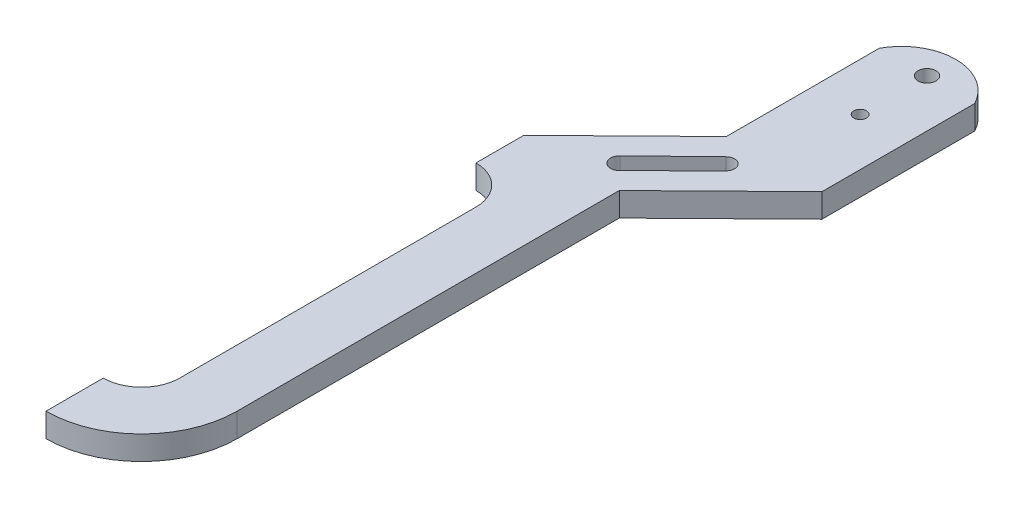
ISO-10303-21;
HEADER;
FILE_DESCRIPTION(('STEP AP214'),'2;1');
FILE_NAME('part.step','',(''),(''),'','','');
FILE_SCHEMA(('AUTOMOTIVE_DESIGN { 1 0 10303 214 1 1 1 1 }'));
ENDSEC;
DATA;
#1=APPLICATION_CONTEXT('core data for automotive mechanical design processes');
#2=APPLICATION_PROTOCOL_DEFINITION('international standard','automotive_design',2000,#1);
#3=PRODUCT_CONTEXT('',#1,'mechanical');
#4=PRODUCT('Part','Part','',(#3));
#5=PRODUCT_RELATED_PRODUCT_CATEGORY('part','',(#4));
#6=PRODUCT_DEFINITION_FORMATION('','',#4);
#7=PRODUCT_DEFINITION_CONTEXT('part definition',#1,'design');
#8=PRODUCT_DEFINITION('design','',#6,#7);
#9=PRODUCT_DEFINITION_SHAPE('','',#8);
#10=(LENGTH_UNIT() NAMED_UNIT(*) SI_UNIT(.MILLI.,.METRE.));
#11=(NAMED_UNIT(*) PLANE_ANGLE_UNIT() SI_UNIT($,.RADIAN.));
#12=(NAMED_UNIT(*) SI_UNIT($,.STERADIAN.) SOLID_ANGLE_UNIT());
#13=UNCERTAINTY_MEASURE_WITH_UNIT(LENGTH_MEASURE(1.E-05),#10,'distance_accuracy_value','');
#14=(GEOMETRIC_REPRESENTATION_CONTEXT(3) GLOBAL_UNCERTAINTY_ASSIGNED_CONTEXT((#13)) GLOBAL_UNIT_ASSIGNED_CONTEXT((#10,
#11,#12)) REPRESENTATION_CONTEXT('',''));
#15=CARTESIAN_POINT('',(0.,0.,0.));
#16=DIRECTION('',(0.,0.,1.));
#17=DIRECTION('',(1.,0.,0.));
#18=AXIS2_PLACEMENT_3D('',#15,#16,#17);
#19=CARTESIAN_POINT('',(-13.6044211563741,3.175,89.535));
#20=DIRECTION('',(0.,-1.,0.));
#21=DIRECTION('',(0.,0.,-1.));
#22=AXIS2_PLACEMENT_3D('',#19,#20,#21);
#23=PLANE('',#22);
#24=CARTESIAN_POINT('',(6.35,3.175,13.97));
#25=DIRECTION('',(0.,1.,0.));
#26=DIRECTION('',(0.,0.,1.));
#27=AXIS2_PLACEMENT_3D('',#24,#25,#26);
#28=CIRCLE('',#27,0.840105);
#29=CARTESIAN_POINT('',(6.35,3.175,14.810105));
#30=VERTEX_POINT('',#29);
#31=EDGE_CURVE('E182',#30,#30,#28,.T.);
#32=ORIENTED_EDGE('',*,*,#31,.F.);
#33=EDGE_LOOP('',(#32));
#34=FACE_BOUND('',#33,.T.);
#35=CARTESIAN_POINT('',(6.35,3.175,5.08));
#36=DIRECTION('',(0.,1.,0.));
#37=DIRECTION('',(0.,0.,1.));
#38=AXIS2_PLACEMENT_3D('',#35,#36,#37);
#39=CIRCLE('',#38,1.190625);
#40=CARTESIAN_POINT('',(6.35,3.175,6.270625));
#41=VERTEX_POINT('',#40);
#42=EDGE_CURVE('E188',#41,#41,#39,.T.);
#43=ORIENTED_EDGE('',*,*,#42,.F.);
#44=EDGE_LOOP('',(#43));
#45=FACE_BOUND('',#44,.T.);
#46=CARTESIAN_POINT('',(-13.6044211563741,3.175,89.535));
#47=DIRECTION('',(0.,1.,0.));
#48=DIRECTION('',(0.,0.,-1.));
#49=AXIS2_PLACEMENT_3D('',#46,#47,#48);
#50=CIRCLE('',#49,12.7);
#51=CARTESIAN_POINT('',(-13.6044211563741,3.175,102.235));
#52=VERTEX_POINT('',#51);
#53=CARTESIAN_POINT('',(-0.90442115637412,3.175,89.535));
#54=VERTEX_POINT('',#53);
#55=EDGE_CURVE('E194',#52,#54,#50,.T.);
#56=ORIENTED_EDGE('',*,*,#55,.T.);
#57=DIRECTION('',(0.,0.,-1.));
#58=VECTOR('',#57,1.);
#59=CARTESIAN_POINT('',(-0.904421156374132,3.175,38.735));
#60=LINE('',#59,#58);
#61=CARTESIAN_POINT('',(-0.904421156374132,3.175,38.735));
#62=VERTEX_POINT('',#61);
#63=EDGE_CURVE('E197',#54,#62,#60,.T.);
#64=ORIENTED_EDGE('',*,*,#63,.T.);
#65=DIRECTION('',(0.714142842854285,0.,-0.7));
#66=VECTOR('',#65,1.);
#67=CARTESIAN_POINT('',(12.7,3.175,25.4));
#68=LINE('',#67,#66);
#69=CARTESIAN_POINT('',(12.7,3.175,25.4));
#70=VERTEX_POINT('',#69);
#71=EDGE_CURVE('E200',#62,#70,#68,.T.);
#72=ORIENTED_EDGE('',*,*,#71,.T.);
#73=DIRECTION('',(0.,0.,-1.));
#74=VECTOR('',#73,1.);
#75=CARTESIAN_POINT('',(12.7,3.175,25.4));
#76=LINE('',#75,#74);
#77=CARTESIAN_POINT('',(12.7,3.175,5.08));
#78=VERTEX_POINT('',#77);
#79=EDGE_CURVE('E202',#70,#78,#76,.T.);
#80=ORIENTED_EDGE('',*,*,#79,.T.);
#81=CARTESIAN_POINT('',(6.35,3.175,8.46666666666668));
#82=DIRECTION('',(0.,1.,0.));
#83=DIRECTION('',(0.,0.,-1.));
#84=AXIS2_PLACEMENT_3D('',#81,#82,#83);
#85=CIRCLE('',#84,7.19666666666667);
#86=CARTESIAN_POINT('',(0.,3.175,5.08));
#87=VERTEX_POINT('',#86);
#88=EDGE_CURVE('E204',#78,#87,#85,.T.);
#89=ORIENTED_EDGE('',*,*,#88,.T.);
#90=DIRECTION('',(0.,0.,1.));
#91=VECTOR('',#90,1.);
#92=CARTESIAN_POINT('',(0.,3.175,5.08));
#93=LINE('',#92,#91);
#94=CARTESIAN_POINT('',(0.,3.175,25.4));
#95=VERTEX_POINT('',#94);
#96=EDGE_CURVE('E206',#87,#95,#93,.T.);
#97=ORIENTED_EDGE('',*,*,#96,.T.);
#98=DIRECTION('',(-0.714142842854285,0.,0.7));
#99=VECTOR('',#98,1.);
#100=CARTESIAN_POINT('',(0.,3.175,25.4));
#101=LINE('',#100,#99);
#102=CARTESIAN_POINT('',(-13.6044211563741,3.175,38.735));
#103=VERTEX_POINT('',#102);
#104=EDGE_CURVE('E208',#95,#103,#101,.T.);
#105=ORIENTED_EDGE('',*,*,#104,.T.);
#106=DIRECTION('',(0.,0.,1.));
#107=VECTOR('',#106,1.);
#108=CARTESIAN_POINT('',(-13.6044211563741,3.175,38.735));
#109=LINE('',#108,#107);
#110=CARTESIAN_POINT('',(-13.6044211563741,3.175,45.085));
#111=VERTEX_POINT('',#110);
#112=EDGE_CURVE('E210',#103,#111,#109,.T.);
#113=ORIENTED_EDGE('',*,*,#112,.T.);
#114=CARTESIAN_POINT('',(-13.6044211563741,3.175,50.165));
#115=DIRECTION('',(0.,-1.,0.));
#116=DIRECTION('',(0.,0.,-1.));
#117=AXIS2_PLACEMENT_3D('',#114,#115,#116);
#118=CIRCLE('',#117,5.08);
#119=CARTESIAN_POINT('',(-8.52442115637412,3.175,50.165));
#120=VERTEX_POINT('',#119);
#121=EDGE_CURVE('E212',#111,#120,#118,.T.);
#122=ORIENTED_EDGE('',*,*,#121,.T.);
#123=DIRECTION('',(0.,0.,1.));
#124=VECTOR('',#123,1.);
#125=CARTESIAN_POINT('',(-8.52442115637412,3.175,50.165));
#126=LINE('',#125,#124);
#127=CARTESIAN_POINT('',(-8.52442115637412,3.175,89.535));
#128=VERTEX_POINT('',#127);
#129=EDGE_CURVE('E214',#120,#128,#126,.T.);
#130=ORIENTED_EDGE('',*,*,#129,.T.);
#131=CARTESIAN_POINT('',(-13.6044211563741,3.175,89.535));
#132=DIRECTION('',(0.,-1.,0.));
#133=DIRECTION('',(0.,0.,-1.));
#134=AXIS2_PLACEMENT_3D('',#131,#132,#133);
#135=CIRCLE('',#134,5.08000000000001);
#136=CARTESIAN_POINT('',(-13.6044211563741,3.175,94.615));
#137=VERTEX_POINT('',#136);
#138=EDGE_CURVE('E216',#128,#137,#135,.T.);
#139=ORIENTED_EDGE('',*,*,#138,.T.);
#140=DIRECTION('',(0.,0.,1.));
#141=VECTOR('',#140,1.);
#142=CARTESIAN_POINT('',(-13.6044211563741,3.175,94.615));
#143=LINE('',#142,#141);
#144=EDGE_CURVE('E218',#137,#52,#143,.T.);
#145=ORIENTED_EDGE('',*,*,#144,.T.);
#146=EDGE_LOOP('',(#56,#64,#72,#80,#89,#97,#105,#113,#122,#130,#139,#145));
#147=FACE_BOUND('',#146,.T.);
#148=CARTESIAN_POINT('',(3.11149308184753,3.175,28.5743577970789));
#149=DIRECTION('',(0.,1.,0.));
#150=DIRECTION('',(0.,0.,1.));
#151=AXIS2_PLACEMENT_3D('',#148,#149,#150);
#152=CIRCLE('',#151,1.15081847955389);
#153=CARTESIAN_POINT('',(3.91706597680281,3.175,29.3962066176025));
#154=VERTEX_POINT('',#153);
#155=CARTESIAN_POINT('',(2.30592018689225,3.175,27.7525089765552));
#156=VERTEX_POINT('',#155);
#157=EDGE_CURVE('E146',#154,#156,#152,.T.);
#158=ORIENTED_EDGE('',*,*,#157,.F.);
#159=DIRECTION('',(0.710114988358506,0.,-0.704085721562793));
#160=VECTOR('',#159,1.);
#161=CARTESIAN_POINT('',(-3.17027228338043,3.175,36.4233694781073));
#162=LINE('',#161,#160);
#163=CARTESIAN_POINT('',(-3.17027228338043,3.175,36.4233694781073));
#164=VERTEX_POINT('',#163);
#165=EDGE_CURVE('E168',#164,#154,#162,.T.);
#166=ORIENTED_EDGE('',*,*,#165,.F.);
#167=CARTESIAN_POINT('',(-4.01592115637413,3.175,35.5606350635127));
#168=DIRECTION('',(0.,1.,0.));
#169=DIRECTION('',(0.,0.,-1.));
#170=AXIS2_PLACEMENT_3D('',#167,#168,#169);
#171=CIRCLE('',#170,1.20806981856242);
#172=CARTESIAN_POINT('',(-4.856606356463,3.175,34.6930631178661));
#173=VERTEX_POINT('',#172);
#174=EDGE_CURVE('E166',#173,#164,#171,.T.);
#175=ORIENTED_EDGE('',*,*,#174,.F.);
#176=DIRECTION('',(-0.718147190101119,0.,0.695891236724438));
#177=VECTOR('',#176,1.);
#178=CARTESIAN_POINT('',(2.30592018689225,3.175,27.7525089765552));
#179=LINE('',#178,#177);
#180=EDGE_CURVE('E154',#156,#173,#179,.T.);
#181=ORIENTED_EDGE('',*,*,#180,.F.);
#182=EDGE_LOOP('',(#158,#166,#175,#181));
#183=FACE_BOUND('',#182,.T.);
#184=ADVANCED_FACE('F33',(#34,#45,#147,#183),#23,.F.);
#185=CARTESIAN_POINT('',(-13.6044211563741,0.,89.535));
#186=DIRECTION('',(0.,-1.,0.));
#187=DIRECTION('',(0.,0.,-1.));
#188=AXIS2_PLACEMENT_3D('',#185,#186,#187);
#189=PLANE('',#188);
#190=CARTESIAN_POINT('',(6.35,0.,5.08));
#191=DIRECTION('',(0.,1.,0.));
#192=DIRECTION('',(0.,0.,1.));
#193=AXIS2_PLACEMENT_3D('',#190,#191,#192);
#194=CIRCLE('',#193,1.190625);
#195=CARTESIAN_POINT('',(6.35,0.,6.270625));
#196=VERTEX_POINT('',#195);
#197=EDGE_CURVE('E185',#196,#196,#194,.T.);
#198=ORIENTED_EDGE('',*,*,#197,.T.);
#199=EDGE_LOOP('',(#198));
#200=FACE_BOUND('',#199,.T.);
#201=CARTESIAN_POINT('',(-13.6044211563741,0.,89.535));
#202=DIRECTION('',(0.,1.,0.));
#203=DIRECTION('',(0.,0.,-1.));
#204=AXIS2_PLACEMENT_3D('',#201,#202,#203);
#205=CIRCLE('',#204,12.7);
#206=CARTESIAN_POINT('',(-13.6044211563741,0.,102.235));
#207=VERTEX_POINT('',#206);
#208=CARTESIAN_POINT('',(-0.90442115637412,0.,89.535));
#209=VERTEX_POINT('',#208);
#210=EDGE_CURVE('E191',#207,#209,#205,.T.);
#211=ORIENTED_EDGE('',*,*,#210,.F.);
#212=DIRECTION('',(0.,0.,1.));
#213=VECTOR('',#212,1.);
#214=CARTESIAN_POINT('',(-13.6044211563741,0.,94.615));
#215=LINE('',#214,#213);
#216=CARTESIAN_POINT('',(-13.6044211563741,0.,94.615));
#217=VERTEX_POINT('',#216);
#218=EDGE_CURVE('E198',#217,#207,#215,.T.);
#219=ORIENTED_EDGE('',*,*,#218,.F.);
#220=CARTESIAN_POINT('',(-13.6044211563741,0.,89.535));
#221=DIRECTION('',(0.,-1.,0.));
#222=DIRECTION('',(0.,0.,-1.));
#223=AXIS2_PLACEMENT_3D('',#220,#221,#222);
#224=CIRCLE('',#223,5.08000000000001);
#225=CARTESIAN_POINT('',(-8.52442115637412,0.,89.535));
#226=VERTEX_POINT('',#225);
#227=EDGE_CURVE('E242',#226,#217,#224,.T.);
#228=ORIENTED_EDGE('',*,*,#227,.F.);
#229=DIRECTION('',(0.,0.,1.));
#230=VECTOR('',#229,1.);
#231=CARTESIAN_POINT('',(-8.52442115637412,0.,50.165));
#232=LINE('',#231,#230);
#233=CARTESIAN_POINT('',(-8.52442115637412,0.,50.165));
#234=VERTEX_POINT('',#233);
#235=EDGE_CURVE('E240',#234,#226,#232,.T.);
#236=ORIENTED_EDGE('',*,*,#235,.F.);
#237=CARTESIAN_POINT('',(-13.6044211563741,0.,50.165));
#238=DIRECTION('',(0.,-1.,0.));
#239=DIRECTION('',(0.,0.,-1.));
#240=AXIS2_PLACEMENT_3D('',#237,#238,#239);
#241=CIRCLE('',#240,5.08);
#242=CARTESIAN_POINT('',(-13.6044211563741,0.,45.085));
#243=VERTEX_POINT('',#242);
#244=EDGE_CURVE('E238',#243,#234,#241,.T.);
#245=ORIENTED_EDGE('',*,*,#244,.F.);
#246=DIRECTION('',(0.,0.,1.));
#247=VECTOR('',#246,1.);
#248=CARTESIAN_POINT('',(-13.6044211563741,0.,38.735));
#249=LINE('',#248,#247);
#250=CARTESIAN_POINT('',(-13.6044211563741,0.,38.735));
#251=VERTEX_POINT('',#250);
#252=EDGE_CURVE('E236',#251,#243,#249,.T.);
#253=ORIENTED_EDGE('',*,*,#252,.F.);
#254=DIRECTION('',(-0.714142842854285,0.,0.7));
#255=VECTOR('',#254,1.);
#256=CARTESIAN_POINT('',(0.,0.,25.4));
#257=LINE('',#256,#255);
#258=CARTESIAN_POINT('',(0.,0.,25.4));
#259=VERTEX_POINT('',#258);
#260=EDGE_CURVE('E234',#259,#251,#257,.T.);
#261=ORIENTED_EDGE('',*,*,#260,.F.);
#262=DIRECTION('',(0.,0.,1.));
#263=VECTOR('',#262,1.);
#264=CARTESIAN_POINT('',(0.,0.,5.08));
#265=LINE('',#264,#263);
#266=CARTESIAN_POINT('',(0.,0.,5.08));
#267=VERTEX_POINT('',#266);
#268=EDGE_CURVE('E232',#267,#259,#265,.T.);
#269=ORIENTED_EDGE('',*,*,#268,.F.);
#270=CARTESIAN_POINT('',(6.35,0.,8.46666666666668));
#271=DIRECTION('',(0.,1.,0.));
#272=DIRECTION('',(0.,0.,1.));
#273=AXIS2_PLACEMENT_3D('',#270,#271,#272);
#274=CIRCLE('',#273,7.19666666666667);
#275=CARTESIAN_POINT('',(12.7,0.,5.08));
#276=VERTEX_POINT('',#275);
#277=EDGE_CURVE('E230',#276,#267,#274,.T.);
#278=ORIENTED_EDGE('',*,*,#277,.F.);
#279=DIRECTION('',(0.,0.,-1.));
#280=VECTOR('',#279,1.);
#281=CARTESIAN_POINT('',(12.7,0.,25.4));
#282=LINE('',#281,#280);
#283=CARTESIAN_POINT('',(12.7,0.,25.4));
#284=VERTEX_POINT('',#283);
#285=EDGE_CURVE('E227',#284,#276,#282,.T.);
#286=ORIENTED_EDGE('',*,*,#285,.F.);
#287=DIRECTION('',(0.714142842854285,0.,-0.7));
#288=VECTOR('',#287,1.);
#289=CARTESIAN_POINT('',(12.7,0.,25.4));
#290=LINE('',#289,#288);
#291=CARTESIAN_POINT('',(-0.904421156374132,0.,38.735));
#292=VERTEX_POINT('',#291);
#293=EDGE_CURVE('E225',#292,#284,#290,.T.);
#294=ORIENTED_EDGE('',*,*,#293,.F.);
#295=DIRECTION('',(0.,0.,-1.));
#296=VECTOR('',#295,1.);
#297=CARTESIAN_POINT('',(-0.904421156374132,0.,38.735));
#298=LINE('',#297,#296);
#299=EDGE_CURVE('E223',#209,#292,#298,.T.);
#300=ORIENTED_EDGE('',*,*,#299,.F.);
#301=EDGE_LOOP('',(#211,#219,#228,#236,#245,#253,#261,#269,#278,#286,#294,#300));
#302=FACE_BOUND('',#301,.T.);
#303=CARTESIAN_POINT('',(6.35,0.,13.97));
#304=DIRECTION('',(0.,1.,0.));
#305=DIRECTION('',(0.,0.,1.));
#306=AXIS2_PLACEMENT_3D('',#303,#304,#305);
#307=CIRCLE('',#306,0.840105);
#308=CARTESIAN_POINT('',(6.35,0.,14.810105));
#309=VERTEX_POINT('',#308);
#310=EDGE_CURVE('E162',#309,#309,#307,.T.);
#311=ORIENTED_EDGE('',*,*,#310,.T.);
#312=EDGE_LOOP('',(#311));
#313=FACE_BOUND('',#312,.T.);
#314=DIRECTION('',(0.710114988358506,0.,-0.704085721562793));
#315=VECTOR('',#314,1.);
#316=CARTESIAN_POINT('',(-3.17027228338043,0.,36.4233694781073));
#317=LINE('',#316,#315);
#318=CARTESIAN_POINT('',(-3.17027228338043,0.,36.4233694781073));
#319=VERTEX_POINT('',#318);
#320=CARTESIAN_POINT('',(3.91706597680282,0.,29.3962066176025));
#321=VERTEX_POINT('',#320);
#322=EDGE_CURVE('E155',#319,#321,#317,.T.);
#323=ORIENTED_EDGE('',*,*,#322,.T.);
#324=CARTESIAN_POINT('',(3.11149308184753,0.,28.5743577970789));
#325=DIRECTION('',(0.,1.,0.));
#326=DIRECTION('',(0.,0.,1.));
#327=AXIS2_PLACEMENT_3D('',#324,#325,#326);
#328=CIRCLE('',#327,1.15081847955389);
#329=CARTESIAN_POINT('',(2.30592018689225,0.,27.7525089765552));
#330=VERTEX_POINT('',#329);
#331=EDGE_CURVE('E56',#321,#330,#328,.T.);
#332=ORIENTED_EDGE('',*,*,#331,.T.);
#333=DIRECTION('',(-0.718147190101119,0.,0.695891236724438));
#334=VECTOR('',#333,1.);
#335=CARTESIAN_POINT('',(2.30592018689225,0.,27.7525089765552));
#336=LINE('',#335,#334);
#337=CARTESIAN_POINT('',(-4.856606356463,0.,34.6930631178661));
#338=VERTEX_POINT('',#337);
#339=EDGE_CURVE('E161',#330,#338,#336,.T.);
#340=ORIENTED_EDGE('',*,*,#339,.T.);
#341=CARTESIAN_POINT('',(-4.01592115637413,0.,35.5606350635127));
#342=DIRECTION('',(0.,1.,0.));
#343=DIRECTION('',(0.,0.,-1.));
#344=AXIS2_PLACEMENT_3D('',#341,#342,#343);
#345=CIRCLE('',#344,1.20806981856242);
#346=EDGE_CURVE('E174',#338,#319,#345,.T.);
#347=ORIENTED_EDGE('',*,*,#346,.T.);
#348=EDGE_LOOP('',(#323,#332,#340,#347));
#349=FACE_BOUND('',#348,.T.);
#350=ADVANCED_FACE('F284',(#200,#302,#313,#349),#189,.T.);
#351=CARTESIAN_POINT('',(-13.6044211563741,3.175,89.535));
#352=DIRECTION('',(0.,-1.,0.));
#353=DIRECTION('',(0.,0.,-1.));
#354=AXIS2_PLACEMENT_3D('',#351,#352,#353);
#355=CYLINDRICAL_SURFACE('',#354,12.7);
#356=ORIENTED_EDGE('',*,*,#210,.T.);
#357=DIRECTION('',(0.,-1.,0.));
#358=VECTOR('',#357,1.);
#359=CARTESIAN_POINT('',(-0.90442115637412,3.175,89.535));
#360=LINE('',#359,#358);
#361=EDGE_CURVE('E11',#54,#209,#360,.T.);
#362=ORIENTED_EDGE('',*,*,#361,.F.);
#363=ORIENTED_EDGE('',*,*,#55,.F.);
#364=DIRECTION('',(0.,-1.,0.));
#365=VECTOR('',#364,1.);
#366=CARTESIAN_POINT('',(-13.6044211563741,3.175,102.235));
#367=LINE('',#366,#365);
#368=EDGE_CURVE('E220',#52,#207,#367,.T.);
#369=ORIENTED_EDGE('',*,*,#368,.T.);
#370=EDGE_LOOP('',(#356,#362,#363,#369));
#371=FACE_BOUND('',#370,.T.);
#372=ADVANCED_FACE('F35',(#371),#355,.T.);
#373=CARTESIAN_POINT('',(-0.904421156374132,3.175,38.735));
#374=DIRECTION('',(-1.,0.,0.));
#375=DIRECTION('',(0.,0.,1.));
#376=AXIS2_PLACEMENT_3D('',#373,#374,#375);
#377=PLANE('',#376);
#378=ORIENTED_EDGE('',*,*,#299,.T.);
#379=DIRECTION('',(0.,-1.,0.));
#380=VECTOR('',#379,1.);
#381=CARTESIAN_POINT('',(-0.904421156374132,3.175,38.735));
#382=LINE('',#381,#380);
#383=EDGE_CURVE('E41',#62,#292,#382,.T.);
#384=ORIENTED_EDGE('',*,*,#383,.F.);
#385=ORIENTED_EDGE('',*,*,#63,.F.);
#386=ORIENTED_EDGE('',*,*,#361,.T.);
#387=EDGE_LOOP('',(#378,#384,#385,#386));
#388=FACE_BOUND('',#387,.T.);
#389=ADVANCED_FACE('F300',(#388),#377,.F.);
#390=CARTESIAN_POINT('',(12.7,3.175,25.4));
#391=DIRECTION('',(-0.7,0.,-0.714142842854285));
#392=DIRECTION('',(-0.714142842854285,0.,0.7));
#393=AXIS2_PLACEMENT_3D('',#390,#391,#392);
#394=PLANE('',#393);
#395=ORIENTED_EDGE('',*,*,#293,.T.);
#396=DIRECTION('',(0.,-1.,0.));
#397=VECTOR('',#396,1.);
#398=CARTESIAN_POINT('',(12.7,3.175,25.4));
#399=LINE('',#398,#397);
#400=EDGE_CURVE('E271',#70,#284,#399,.T.);
#401=ORIENTED_EDGE('',*,*,#400,.F.);
#402=ORIENTED_EDGE('',*,*,#71,.F.);
#403=ORIENTED_EDGE('',*,*,#383,.T.);
#404=EDGE_LOOP('',(#395,#401,#402,#403));
#405=FACE_BOUND('',#404,.T.);
#406=ADVANCED_FACE('F278',(#405),#394,.F.);
#407=CARTESIAN_POINT('',(12.7,3.175,25.4));
#408=DIRECTION('',(-1.,0.,0.));
#409=DIRECTION('',(0.,0.,1.));
#410=AXIS2_PLACEMENT_3D('',#407,#408,#409);
#411=PLANE('',#410);
#412=ORIENTED_EDGE('',*,*,#285,.T.);
#413=DIRECTION('',(0.,-1.,0.));
#414=VECTOR('',#413,1.);
#415=CARTESIAN_POINT('',(12.7,3.175,5.08));
#416=LINE('',#415,#414);
#417=EDGE_CURVE('E268',#78,#276,#416,.T.);
#418=ORIENTED_EDGE('',*,*,#417,.F.);
#419=ORIENTED_EDGE('',*,*,#79,.F.);
#420=ORIENTED_EDGE('',*,*,#400,.T.);
#421=EDGE_LOOP('',(#412,#418,#419,#420));
#422=FACE_BOUND('',#421,.T.);
#423=ADVANCED_FACE('F289',(#422),#411,.F.);
#424=CARTESIAN_POINT('',(6.35,3.175,8.46666666666668));
#425=DIRECTION('',(0.,-1.,0.));
#426=DIRECTION('',(0.,0.,-1.));
#427=AXIS2_PLACEMENT_3D('',#424,#425,#426);
#428=CYLINDRICAL_SURFACE('',#427,7.19666666666667);
#429=ORIENTED_EDGE('',*,*,#277,.T.);
#430=DIRECTION('',(0.,-1.,0.));
#431=VECTOR('',#430,1.);
#432=CARTESIAN_POINT('',(0.,3.175,5.08));
#433=LINE('',#432,#431);
#434=EDGE_CURVE('E265',#87,#267,#433,.T.);
#435=ORIENTED_EDGE('',*,*,#434,.F.);
#436=ORIENTED_EDGE('',*,*,#88,.F.);
#437=ORIENTED_EDGE('',*,*,#417,.T.);
#438=EDGE_LOOP('',(#429,#435,#436,#437));
#439=FACE_BOUND('',#438,.T.);
#440=ADVANCED_FACE('F293',(#439),#428,.T.);
#441=CARTESIAN_POINT('',(0.,3.175,5.08));
#442=DIRECTION('',(1.,0.,0.));
#443=DIRECTION('',(0.,0.,-1.));
#444=AXIS2_PLACEMENT_3D('',#441,#442,#443);
#445=PLANE('',#444);
#446=ORIENTED_EDGE('',*,*,#268,.T.);
#447=DIRECTION('',(0.,-1.,0.));
#448=VECTOR('',#447,1.);
#449=CARTESIAN_POINT('',(0.,3.175,25.4));
#450=LINE('',#449,#448);
#451=EDGE_CURVE('E262',#95,#259,#450,.T.);
#452=ORIENTED_EDGE('',*,*,#451,.F.);
#453=ORIENTED_EDGE('',*,*,#96,.F.);
#454=ORIENTED_EDGE('',*,*,#434,.T.);
#455=EDGE_LOOP('',(#446,#452,#453,#454));
#456=FACE_BOUND('',#455,.T.);
#457=ADVANCED_FACE('F333',(#456),#445,.F.);
#458=CARTESIAN_POINT('',(0.,3.175,25.4));
#459=DIRECTION('',(0.7,0.,0.714142842854285));
#460=DIRECTION('',(0.714142842854285,0.,-0.7));
#461=AXIS2_PLACEMENT_3D('',#458,#459,#460);
#462=PLANE('',#461);
#463=ORIENTED_EDGE('',*,*,#260,.T.);
#464=DIRECTION('',(0.,-1.,0.));
#465=VECTOR('',#464,1.);
#466=CARTESIAN_POINT('',(-13.6044211563741,3.175,38.735));
#467=LINE('',#466,#465);
#468=EDGE_CURVE('E259',#103,#251,#467,.T.);
#469=ORIENTED_EDGE('',*,*,#468,.F.);
#470=ORIENTED_EDGE('',*,*,#104,.F.);
#471=ORIENTED_EDGE('',*,*,#451,.T.);
#472=EDGE_LOOP('',(#463,#469,#470,#471));
#473=FACE_BOUND('',#472,.T.);
#474=ADVANCED_FACE('F331',(#473),#462,.F.);
#475=CARTESIAN_POINT('',(-13.6044211563741,3.175,38.735));
#476=DIRECTION('',(1.,0.,0.));
#477=DIRECTION('',(0.,0.,-1.));
#478=AXIS2_PLACEMENT_3D('',#475,#476,#477);
#479=PLANE('',#478);
#480=ORIENTED_EDGE('',*,*,#252,.T.);
#481=DIRECTION('',(0.,-1.,0.));
#482=VECTOR('',#481,1.);
#483=CARTESIAN_POINT('',(-13.6044211563741,3.175,45.085));
#484=LINE('',#483,#482);
#485=EDGE_CURVE('E256',#111,#243,#484,.T.);
#486=ORIENTED_EDGE('',*,*,#485,.F.);
#487=ORIENTED_EDGE('',*,*,#112,.F.);
#488=ORIENTED_EDGE('',*,*,#468,.T.);
#489=EDGE_LOOP('',(#480,#486,#487,#488));
#490=FACE_BOUND('',#489,.T.);
#491=ADVANCED_FACE('F327',(#490),#479,.F.);
#492=CARTESIAN_POINT('',(-13.6044211563741,3.175,50.165));
#493=DIRECTION('',(0.,-1.,0.));
#494=DIRECTION('',(0.,0.,-1.));
#495=AXIS2_PLACEMENT_3D('',#492,#493,#494);
#496=CYLINDRICAL_SURFACE('',#495,5.08);
#497=ORIENTED_EDGE('',*,*,#244,.T.);
#498=DIRECTION('',(0.,-1.,0.));
#499=VECTOR('',#498,1.);
#500=CARTESIAN_POINT('',(-8.52442115637412,3.175,50.165));
#501=LINE('',#500,#499);
#502=EDGE_CURVE('E253',#120,#234,#501,.T.);
#503=ORIENTED_EDGE('',*,*,#502,.F.);
#504=ORIENTED_EDGE('',*,*,#121,.F.);
#505=ORIENTED_EDGE('',*,*,#485,.T.);
#506=EDGE_LOOP('',(#497,#503,#504,#505));
#507=FACE_BOUND('',#506,.T.);
#508=ADVANCED_FACE('F322',(#507),#496,.F.);
#509=CARTESIAN_POINT('',(-8.52442115637412,3.175,50.165));
#510=DIRECTION('',(1.,0.,0.));
#511=DIRECTION('',(0.,0.,-1.));
#512=AXIS2_PLACEMENT_3D('',#509,#510,#511);
#513=PLANE('',#512);
#514=ORIENTED_EDGE('',*,*,#235,.T.);
#515=DIRECTION('',(0.,-1.,0.));
#516=VECTOR('',#515,1.);
#517=CARTESIAN_POINT('',(-8.52442115637412,3.175,89.535));
#518=LINE('',#517,#516);
#519=EDGE_CURVE('E250',#128,#226,#518,.T.);
#520=ORIENTED_EDGE('',*,*,#519,.F.);
#521=ORIENTED_EDGE('',*,*,#129,.F.);
#522=ORIENTED_EDGE('',*,*,#502,.T.);
#523=EDGE_LOOP('',(#514,#520,#521,#522));
#524=FACE_BOUND('',#523,.T.);
#525=ADVANCED_FACE('F316',(#524),#513,.F.);
#526=CARTESIAN_POINT('',(-13.6044211563741,3.175,89.535));
#527=DIRECTION('',(0.,-1.,0.));
#528=DIRECTION('',(0.,0.,-1.));
#529=AXIS2_PLACEMENT_3D('',#526,#527,#528);
#530=CYLINDRICAL_SURFACE('',#529,5.08000000000001);
#531=ORIENTED_EDGE('',*,*,#227,.T.);
#532=DIRECTION('',(0.,-1.,0.));
#533=VECTOR('',#532,1.);
#534=CARTESIAN_POINT('',(-13.6044211563741,3.175,94.615));
#535=LINE('',#534,#533);
#536=EDGE_CURVE('E247',#137,#217,#535,.T.);
#537=ORIENTED_EDGE('',*,*,#536,.F.);
#538=ORIENTED_EDGE('',*,*,#138,.F.);
#539=ORIENTED_EDGE('',*,*,#519,.T.);
#540=EDGE_LOOP('',(#531,#537,#538,#539));
#541=FACE_BOUND('',#540,.T.);
#542=ADVANCED_FACE('F312',(#541),#530,.F.);
#543=CARTESIAN_POINT('',(-13.6044211563741,3.175,94.615));
#544=DIRECTION('',(1.,0.,0.));
#545=DIRECTION('',(0.,0.,-1.));
#546=AXIS2_PLACEMENT_3D('',#543,#544,#545);
#547=PLANE('',#546);
#548=ORIENTED_EDGE('',*,*,#218,.T.);
#549=ORIENTED_EDGE('',*,*,#368,.F.);
#550=ORIENTED_EDGE('',*,*,#144,.F.);
#551=ORIENTED_EDGE('',*,*,#536,.T.);
#552=EDGE_LOOP('',(#548,#549,#550,#551));
#553=FACE_BOUND('',#552,.T.);
#554=ADVANCED_FACE('F307',(#553),#547,.F.);
#555=CARTESIAN_POINT('',(6.35,3.175,5.08));
#556=DIRECTION('',(0.,-1.,0.));
#557=DIRECTION('',(0.,0.,-1.));
#558=AXIS2_PLACEMENT_3D('',#555,#556,#557);
#559=CYLINDRICAL_SURFACE('',#558,1.190625);
#560=ORIENTED_EDGE('',*,*,#42,.T.);
#561=EDGE_LOOP('',(#560));
#562=FACE_BOUND('',#561,.T.);
#563=ORIENTED_EDGE('',*,*,#197,.F.);
#564=EDGE_LOOP('',(#563));
#565=FACE_BOUND('',#564,.T.);
#566=ADVANCED_FACE('F353',(#562,#565),#559,.F.);
#567=CARTESIAN_POINT('',(6.35,3.175,13.97));
#568=DIRECTION('',(0.,-1.,0.));
#569=DIRECTION('',(0.,0.,-1.));
#570=AXIS2_PLACEMENT_3D('',#567,#568,#569);
#571=CYLINDRICAL_SURFACE('',#570,0.840105);
#572=ORIENTED_EDGE('',*,*,#31,.T.);
#573=EDGE_LOOP('',(#572));
#574=FACE_BOUND('',#573,.T.);
#575=ORIENTED_EDGE('',*,*,#310,.F.);
#576=EDGE_LOOP('',(#575));
#577=FACE_BOUND('',#576,.T.);
#578=ADVANCED_FACE('F391',(#574,#577),#571,.F.);
#579=CARTESIAN_POINT('',(3.11149308184753,3.175,28.5743577970789));
#580=DIRECTION('',(0.,-1.,0.));
#581=DIRECTION('',(0.,0.,-1.));
#582=AXIS2_PLACEMENT_3D('',#579,#580,#581);
#583=CYLINDRICAL_SURFACE('',#582,1.15081847955389);
#584=ORIENTED_EDGE('',*,*,#331,.F.);
#585=DIRECTION('',(0.,-1.,0.));
#586=VECTOR('',#585,1.);
#587=CARTESIAN_POINT('',(3.91706597680281,3.175,29.3962066176025));
#588=LINE('',#587,#586);
#589=EDGE_CURVE('E150',#154,#321,#588,.T.);
#590=ORIENTED_EDGE('',*,*,#589,.F.);
#591=ORIENTED_EDGE('',*,*,#157,.T.);
#592=DIRECTION('',(0.,-1.,0.));
#593=VECTOR('',#592,1.);
#594=CARTESIAN_POINT('',(2.30592018689225,3.175,27.7525089765552));
#595=LINE('',#594,#593);
#596=EDGE_CURVE('E149',#156,#330,#595,.T.);
#597=ORIENTED_EDGE('',*,*,#596,.T.);
#598=EDGE_LOOP('',(#584,#590,#591,#597));
#599=FACE_BOUND('',#598,.T.);
#600=ADVANCED_FACE('F148',(#599),#583,.F.);
#601=CARTESIAN_POINT('',(2.30592018689225,3.175,27.7525089765552));
#602=DIRECTION('',(0.695891236724438,0.,0.718147190101119));
#603=DIRECTION('',(0.718147190101119,0.,-0.695891236724438));
#604=AXIS2_PLACEMENT_3D('',#601,#602,#603);
#605=PLANE('',#604);
#606=ORIENTED_EDGE('',*,*,#339,.F.);
#607=ORIENTED_EDGE('',*,*,#596,.F.);
#608=ORIENTED_EDGE('',*,*,#180,.T.);
#609=DIRECTION('',(0.,-1.,0.));
#610=VECTOR('',#609,1.);
#611=CARTESIAN_POINT('',(-4.856606356463,3.175,34.6930631178661));
#612=LINE('',#611,#610);
#613=EDGE_CURVE('E163',#173,#338,#612,.T.);
#614=ORIENTED_EDGE('',*,*,#613,.T.);
#615=EDGE_LOOP('',(#606,#607,#608,#614));
#616=FACE_BOUND('',#615,.T.);
#617=ADVANCED_FACE('F158',(#616),#605,.T.);
#618=CARTESIAN_POINT('',(-4.01592115637413,3.175,35.5606350635127));
#619=DIRECTION('',(0.,-1.,0.));
#620=DIRECTION('',(0.,0.,-1.));
#621=AXIS2_PLACEMENT_3D('',#618,#619,#620);
#622=CYLINDRICAL_SURFACE('',#621,1.20806981856242);
#623=ORIENTED_EDGE('',*,*,#346,.F.);
#624=ORIENTED_EDGE('',*,*,#613,.F.);
#625=ORIENTED_EDGE('',*,*,#174,.T.);
#626=DIRECTION('',(0.,-1.,0.));
#627=VECTOR('',#626,1.);
#628=CARTESIAN_POINT('',(-3.17027228338043,3.175,36.4233694781073));
#629=LINE('',#628,#627);
#630=EDGE_CURVE('E48',#164,#319,#629,.T.);
#631=ORIENTED_EDGE('',*,*,#630,.T.);
#632=EDGE_LOOP('',(#623,#624,#625,#631));
#633=FACE_BOUND('',#632,.T.);
#634=ADVANCED_FACE('F410',(#633),#622,.F.);
#635=CARTESIAN_POINT('',(-3.17027228338043,3.175,36.4233694781073));
#636=DIRECTION('',(-0.704085721562793,0.,-0.710114988358506));
#637=DIRECTION('',(-0.710114988358506,0.,0.704085721562793));
#638=AXIS2_PLACEMENT_3D('',#635,#636,#637);
#639=PLANE('',#638);
#640=ORIENTED_EDGE('',*,*,#322,.F.);
#641=ORIENTED_EDGE('',*,*,#630,.F.);
#642=ORIENTED_EDGE('',*,*,#165,.T.);
#643=ORIENTED_EDGE('',*,*,#589,.T.);
#644=EDGE_LOOP('',(#640,#641,#642,#643));
#645=FACE_BOUND('',#644,.T.);
#646=ADVANCED_FACE('F417',(#645),#639,.T.);
#647=CLOSED_SHELL('',(#184,#350,#372,#389,#406,#423,#440,#457,#474,#491,#508,#525,#542,#554,
#566,#578,#600,#617,#634,#646));
#648=MANIFOLD_SOLID_BREP('B2',#647);
#649=ADVANCED_BREP_SHAPE_REPRESENTATION('',(#18,#648),#14);
#650=SHAPE_DEFINITION_REPRESENTATION(#9,#649);
ENDSEC;
END-ISO-10303-21;
